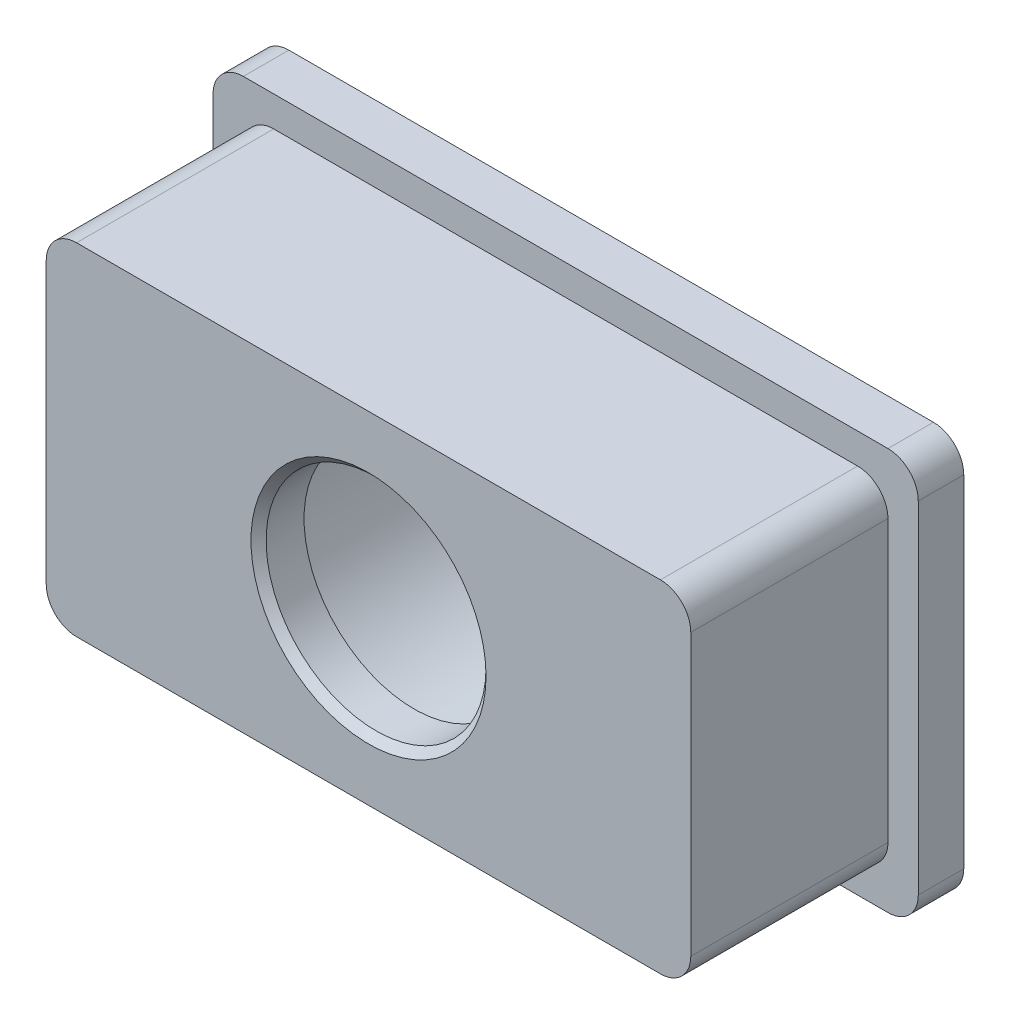
ISO-10303-21;
HEADER;
FILE_DESCRIPTION(('STEP AP214'),'2;1');
FILE_NAME('part.step','',(''),(''),'','','');
FILE_SCHEMA(('AUTOMOTIVE_DESIGN { 1 0 10303 214 1 1 1 1 }'));
ENDSEC;
DATA;
#1=APPLICATION_CONTEXT('core data for automotive mechanical design processes');
#2=APPLICATION_PROTOCOL_DEFINITION('international standard','automotive_design',2000,#1);
#3=PRODUCT_CONTEXT('',#1,'mechanical');
#4=PRODUCT('Part','Part','',(#3));
#5=PRODUCT_RELATED_PRODUCT_CATEGORY('part','',(#4));
#6=PRODUCT_DEFINITION_FORMATION('','',#4);
#7=PRODUCT_DEFINITION_CONTEXT('part definition',#1,'design');
#8=PRODUCT_DEFINITION('design','',#6,#7);
#9=PRODUCT_DEFINITION_SHAPE('','',#8);
#10=(LENGTH_UNIT() NAMED_UNIT(*) SI_UNIT(.MILLI.,.METRE.));
#11=(NAMED_UNIT(*) PLANE_ANGLE_UNIT() SI_UNIT($,.RADIAN.));
#12=(NAMED_UNIT(*) SI_UNIT($,.STERADIAN.) SOLID_ANGLE_UNIT());
#13=UNCERTAINTY_MEASURE_WITH_UNIT(LENGTH_MEASURE(1.E-05),#10,'distance_accuracy_value','');
#14=(GEOMETRIC_REPRESENTATION_CONTEXT(3) GLOBAL_UNCERTAINTY_ASSIGNED_CONTEXT((#13)) GLOBAL_UNIT_ASSIGNED_CONTEXT((#10,
#11,#12)) REPRESENTATION_CONTEXT('',''));
#15=CARTESIAN_POINT('',(0.,0.,0.));
#16=DIRECTION('',(0.,0.,1.));
#17=DIRECTION('',(1.,0.,0.));
#18=AXIS2_PLACEMENT_3D('',#15,#16,#17);
#19=CARTESIAN_POINT('',(0.,0.,13.001));
#20=DIRECTION('',(0.,0.,-1.));
#21=DIRECTION('',(-1.,0.,0.));
#22=AXIS2_PLACEMENT_3D('',#19,#20,#21);
#23=CYLINDRICAL_SURFACE('',#22,10.25);
#24=CARTESIAN_POINT('',(0.,0.,-2.49999999999999));
#25=DIRECTION('',(0.,0.,-1.));
#26=DIRECTION('',(-1.,0.,0.));
#27=AXIS2_PLACEMENT_3D('',#24,#25,#26);
#28=CIRCLE('',#27,10.25);
#29=CARTESIAN_POINT('',(-10.25,0.,-2.49999999999999));
#30=VERTEX_POINT('',#29);
#31=EDGE_CURVE('E42',#30,#30,#28,.T.);
#32=ORIENTED_EDGE('',*,*,#31,.T.);
#33=EDGE_LOOP('',(#32));
#34=FACE_BOUND('',#33,.T.);
#35=CARTESIAN_POINT('',(0.,0.,10.));
#36=DIRECTION('',(0.,0.,1.));
#37=DIRECTION('',(1.,0.,0.));
#38=AXIS2_PLACEMENT_3D('',#35,#36,#37);
#39=CIRCLE('',#38,10.25);
#40=CARTESIAN_POINT('',(10.25,0.,10.));
#41=VERTEX_POINT('',#40);
#42=EDGE_CURVE('E202',#41,#41,#39,.F.);
#43=ORIENTED_EDGE('',*,*,#42,.F.);
#44=EDGE_LOOP('',(#43));
#45=FACE_BOUND('',#44,.T.);
#46=ADVANCED_FACE('F34',(#34,#45),#23,.F.);
#47=CARTESIAN_POINT('',(21.25,11.25,13.));
#48=DIRECTION('',(-1.,0.,0.));
#49=DIRECTION('',(0.,0.,1.));
#50=AXIS2_PLACEMENT_3D('',#47,#48,#49);
#51=PLANE('',#50);
#52=DIRECTION('',(0.,1.,0.));
#53=VECTOR('',#52,1.);
#54=CARTESIAN_POINT('',(21.25,11.25,0.));
#55=LINE('',#54,#53);
#56=CARTESIAN_POINT('',(21.25,-9.24999999999999,0.));
#57=VERTEX_POINT('',#56);
#58=CARTESIAN_POINT('',(21.25,9.25,0.));
#59=VERTEX_POINT('',#58);
#60=EDGE_CURVE('E203',#57,#59,#55,.T.);
#61=ORIENTED_EDGE('',*,*,#60,.T.);
#62=DIRECTION('',(0.,0.,-1.));
#63=VECTOR('',#62,1.);
#64=CARTESIAN_POINT('',(21.25,9.25,13.));
#65=LINE('',#64,#63);
#66=CARTESIAN_POINT('',(21.25,9.25,13.));
#67=VERTEX_POINT('',#66);
#68=EDGE_CURVE('E249',#59,#67,#65,.F.);
#69=ORIENTED_EDGE('',*,*,#68,.T.);
#70=DIRECTION('',(0.,1.,0.));
#71=VECTOR('',#70,1.);
#72=CARTESIAN_POINT('',(21.25,11.25,13.));
#73=LINE('',#72,#71);
#74=CARTESIAN_POINT('',(21.25,-9.24999999999999,13.));
#75=VERTEX_POINT('',#74);
#76=EDGE_CURVE('E191',#75,#67,#73,.T.);
#77=ORIENTED_EDGE('',*,*,#76,.F.);
#78=DIRECTION('',(0.,0.,-1.));
#79=VECTOR('',#78,1.);
#80=CARTESIAN_POINT('',(21.25,-9.25,13.));
#81=LINE('',#80,#79);
#82=EDGE_CURVE('E246',#75,#57,#81,.T.);
#83=ORIENTED_EDGE('',*,*,#82,.T.);
#84=EDGE_LOOP('',(#61,#69,#77,#83));
#85=FACE_BOUND('',#84,.T.);
#86=ADVANCED_FACE('F295',(#85),#51,.F.);
#87=CARTESIAN_POINT('',(-21.25,11.25,13.));
#88=DIRECTION('',(0.,-1.,0.));
#89=DIRECTION('',(0.,0.,-1.));
#90=AXIS2_PLACEMENT_3D('',#87,#88,#89);
#91=PLANE('',#90);
#92=DIRECTION('',(-1.,0.,0.));
#93=VECTOR('',#92,1.);
#94=CARTESIAN_POINT('',(-21.25,11.25,13.));
#95=LINE('',#94,#93);
#96=CARTESIAN_POINT('',(19.25,11.25,13.));
#97=VERTEX_POINT('',#96);
#98=CARTESIAN_POINT('',(-19.25,11.25,13.));
#99=VERTEX_POINT('',#98);
#100=EDGE_CURVE('E194',#97,#99,#95,.T.);
#101=ORIENTED_EDGE('',*,*,#100,.F.);
#102=DIRECTION('',(0.,0.,-1.));
#103=VECTOR('',#102,1.);
#104=CARTESIAN_POINT('',(19.25,11.25,13.));
#105=LINE('',#104,#103);
#106=CARTESIAN_POINT('',(19.25,11.25,0.));
#107=VERTEX_POINT('',#106);
#108=EDGE_CURVE('E243',#97,#107,#105,.T.);
#109=ORIENTED_EDGE('',*,*,#108,.T.);
#110=DIRECTION('',(-1.,0.,0.));
#111=VECTOR('',#110,1.);
#112=CARTESIAN_POINT('',(-21.25,11.25,0.));
#113=LINE('',#112,#111);
#114=CARTESIAN_POINT('',(-19.25,11.25,0.));
#115=VERTEX_POINT('',#114);
#116=EDGE_CURVE('E206',#107,#115,#113,.T.);
#117=ORIENTED_EDGE('',*,*,#116,.T.);
#118=DIRECTION('',(0.,0.,-1.));
#119=VECTOR('',#118,1.);
#120=CARTESIAN_POINT('',(-19.25,11.25,13.));
#121=LINE('',#120,#119);
#122=EDGE_CURVE('E241',#115,#99,#121,.F.);
#123=ORIENTED_EDGE('',*,*,#122,.T.);
#124=EDGE_LOOP('',(#101,#109,#117,#123));
#125=FACE_BOUND('',#124,.T.);
#126=ADVANCED_FACE('F300',(#125),#91,.F.);
#127=CARTESIAN_POINT('',(-21.25,11.25,13.));
#128=DIRECTION('',(1.,0.,0.));
#129=DIRECTION('',(0.,1.,0.));
#130=AXIS2_PLACEMENT_3D('',#127,#128,#129);
#131=PLANE('',#130);
#132=DIRECTION('',(0.,-1.,0.));
#133=VECTOR('',#132,1.);
#134=CARTESIAN_POINT('',(-21.25,11.25,13.));
#135=LINE('',#134,#133);
#136=CARTESIAN_POINT('',(-21.25,9.25,13.));
#137=VERTEX_POINT('',#136);
#138=CARTESIAN_POINT('',(-21.25,-9.24999999999999,13.));
#139=VERTEX_POINT('',#138);
#140=EDGE_CURVE('E198',#137,#139,#135,.T.);
#141=ORIENTED_EDGE('',*,*,#140,.F.);
#142=DIRECTION('',(0.,0.,-1.));
#143=VECTOR('',#142,1.);
#144=CARTESIAN_POINT('',(-21.25,9.25,13.));
#145=LINE('',#144,#143);
#146=CARTESIAN_POINT('',(-21.25,9.25,0.));
#147=VERTEX_POINT('',#146);
#148=EDGE_CURVE('E260',#137,#147,#145,.T.);
#149=ORIENTED_EDGE('',*,*,#148,.T.);
#150=DIRECTION('',(0.,-1.,0.));
#151=VECTOR('',#150,1.);
#152=CARTESIAN_POINT('',(-21.25,11.25,0.));
#153=LINE('',#152,#151);
#154=CARTESIAN_POINT('',(-21.25,-9.24999999999999,0.));
#155=VERTEX_POINT('',#154);
#156=EDGE_CURVE('E209',#147,#155,#153,.T.);
#157=ORIENTED_EDGE('',*,*,#156,.T.);
#158=DIRECTION('',(0.,0.,-1.));
#159=VECTOR('',#158,1.);
#160=CARTESIAN_POINT('',(-21.25,-9.25,13.));
#161=LINE('',#160,#159);
#162=EDGE_CURVE('E258',#155,#139,#161,.F.);
#163=ORIENTED_EDGE('',*,*,#162,.T.);
#164=EDGE_LOOP('',(#141,#149,#157,#163));
#165=FACE_BOUND('',#164,.T.);
#166=ADVANCED_FACE('F335',(#165),#131,.F.);
#167=CARTESIAN_POINT('',(-21.25,-11.25,13.));
#168=DIRECTION('',(0.,1.,0.));
#169=DIRECTION('',(0.,0.,1.));
#170=AXIS2_PLACEMENT_3D('',#167,#168,#169);
#171=PLANE('',#170);
#172=DIRECTION('',(1.,0.,0.));
#173=VECTOR('',#172,1.);
#174=CARTESIAN_POINT('',(-21.25,-11.25,13.));
#175=LINE('',#174,#173);
#176=CARTESIAN_POINT('',(-19.25,-11.25,13.));
#177=VERTEX_POINT('',#176);
#178=CARTESIAN_POINT('',(19.25,-11.25,13.));
#179=VERTEX_POINT('',#178);
#180=EDGE_CURVE('E200',#177,#179,#175,.T.);
#181=ORIENTED_EDGE('',*,*,#180,.F.);
#182=DIRECTION('',(0.,0.,-1.));
#183=VECTOR('',#182,1.);
#184=CARTESIAN_POINT('',(-19.25,-11.25,13.));
#185=LINE('',#184,#183);
#186=CARTESIAN_POINT('',(-19.25,-11.25,0.));
#187=VERTEX_POINT('',#186);
#188=EDGE_CURVE('E264',#177,#187,#185,.T.);
#189=ORIENTED_EDGE('',*,*,#188,.T.);
#190=DIRECTION('',(1.,0.,0.));
#191=VECTOR('',#190,1.);
#192=CARTESIAN_POINT('',(-21.25,-11.25,0.));
#193=LINE('',#192,#191);
#194=CARTESIAN_POINT('',(19.25,-11.25,0.));
#195=VERTEX_POINT('',#194);
#196=EDGE_CURVE('E195',#187,#195,#193,.T.);
#197=ORIENTED_EDGE('',*,*,#196,.T.);
#198=DIRECTION('',(0.,0.,-1.));
#199=VECTOR('',#198,1.);
#200=CARTESIAN_POINT('',(19.25,-11.25,13.));
#201=LINE('',#200,#199);
#202=EDGE_CURVE('E49',#195,#179,#201,.F.);
#203=ORIENTED_EDGE('',*,*,#202,.T.);
#204=EDGE_LOOP('',(#181,#189,#197,#203));
#205=FACE_BOUND('',#204,.T.);
#206=ADVANCED_FACE('F331',(#205),#171,.F.);
#207=CARTESIAN_POINT('',(0.,0.,13.));
#208=DIRECTION('',(0.,0.,1.));
#209=DIRECTION('',(1.,0.,0.));
#210=AXIS2_PLACEMENT_3D('',#207,#208,#209);
#211=PLANE('',#210);
#212=CARTESIAN_POINT('',(0.,0.,13.));
#213=DIRECTION('',(0.,0.,1.));
#214=DIRECTION('',(1.,0.,0.));
#215=AXIS2_PLACEMENT_3D('',#212,#213,#214);
#216=CIRCLE('',#215,7.75000000000002);
#217=CARTESIAN_POINT('',(7.75000000000002,0.,13.));
#218=VERTEX_POINT('',#217);
#219=EDGE_CURVE('E278',#218,#218,#216,.F.);
#220=ORIENTED_EDGE('',*,*,#219,.T.);
#221=EDGE_LOOP('',(#220));
#222=FACE_BOUND('',#221,.T.);
#223=ORIENTED_EDGE('',*,*,#76,.T.);
#224=CARTESIAN_POINT('',(19.25,9.25,13.));
#225=DIRECTION('',(0.,0.,1.));
#226=DIRECTION('',(1.,0.,0.));
#227=AXIS2_PLACEMENT_3D('',#224,#225,#226);
#228=CIRCLE('',#227,2.);
#229=EDGE_CURVE('E256',#67,#97,#228,.T.);
#230=ORIENTED_EDGE('',*,*,#229,.T.);
#231=ORIENTED_EDGE('',*,*,#100,.T.);
#232=CARTESIAN_POINT('',(-19.25,9.25,13.));
#233=DIRECTION('',(0.,0.,1.));
#234=DIRECTION('',(1.,0.,0.));
#235=AXIS2_PLACEMENT_3D('',#232,#233,#234);
#236=CIRCLE('',#235,2.);
#237=EDGE_CURVE('E254',#99,#137,#236,.T.);
#238=ORIENTED_EDGE('',*,*,#237,.T.);
#239=ORIENTED_EDGE('',*,*,#140,.T.);
#240=CARTESIAN_POINT('',(-19.25,-9.25,13.));
#241=DIRECTION('',(0.,0.,1.));
#242=DIRECTION('',(1.,0.,0.));
#243=AXIS2_PLACEMENT_3D('',#240,#241,#242);
#244=CIRCLE('',#243,2.);
#245=EDGE_CURVE('E56',#139,#177,#244,.T.);
#246=ORIENTED_EDGE('',*,*,#245,.T.);
#247=ORIENTED_EDGE('',*,*,#180,.T.);
#248=CARTESIAN_POINT('',(19.25,-9.25,13.));
#249=DIRECTION('',(0.,0.,1.));
#250=DIRECTION('',(1.,0.,0.));
#251=AXIS2_PLACEMENT_3D('',#248,#249,#250);
#252=CIRCLE('',#251,2.);
#253=EDGE_CURVE('E251',#179,#75,#252,.T.);
#254=ORIENTED_EDGE('',*,*,#253,.T.);
#255=EDGE_LOOP('',(#223,#230,#231,#238,#239,#246,#247,#254));
#256=FACE_BOUND('',#255,.T.);
#257=ADVANCED_FACE('F328',(#222,#256),#211,.T.);
#258=CARTESIAN_POINT('',(-23.25,13.25,-3.));
#259=DIRECTION('',(1.,0.,0.));
#260=DIRECTION('',(0.,0.,-1.));
#261=AXIS2_PLACEMENT_3D('',#258,#259,#260);
#262=PLANE('',#261);
#263=DIRECTION('',(0.,1.,0.));
#264=VECTOR('',#263,1.);
#265=CARTESIAN_POINT('',(-23.25,13.25,-3.));
#266=LINE('',#265,#264);
#267=CARTESIAN_POINT('',(-23.25,-11.25,-3.));
#268=VERTEX_POINT('',#267);
#269=CARTESIAN_POINT('',(-23.25,11.25,-3.));
#270=VERTEX_POINT('',#269);
#271=EDGE_CURVE('E169',#268,#270,#266,.T.);
#272=ORIENTED_EDGE('',*,*,#271,.F.);
#273=DIRECTION('',(0.,0.,1.));
#274=VECTOR('',#273,1.);
#275=CARTESIAN_POINT('',(-23.25,-11.25,-3.));
#276=LINE('',#275,#274);
#277=CARTESIAN_POINT('',(-23.25,-11.25,0.));
#278=VERTEX_POINT('',#277);
#279=EDGE_CURVE('E153',#268,#278,#276,.T.);
#280=ORIENTED_EDGE('',*,*,#279,.T.);
#281=DIRECTION('',(0.,1.,0.));
#282=VECTOR('',#281,1.);
#283=CARTESIAN_POINT('',(-23.25,13.25,0.));
#284=LINE('',#283,#282);
#285=CARTESIAN_POINT('',(-23.25,11.25,0.));
#286=VERTEX_POINT('',#285);
#287=EDGE_CURVE('E166',#278,#286,#284,.T.);
#288=ORIENTED_EDGE('',*,*,#287,.T.);
#289=DIRECTION('',(0.,0.,1.));
#290=VECTOR('',#289,1.);
#291=CARTESIAN_POINT('',(-23.25,11.25,-3.));
#292=LINE('',#291,#290);
#293=EDGE_CURVE('E171',#286,#270,#292,.F.);
#294=ORIENTED_EDGE('',*,*,#293,.T.);
#295=EDGE_LOOP('',(#272,#280,#288,#294));
#296=FACE_BOUND('',#295,.T.);
#297=ADVANCED_FACE('F165',(#296),#262,.F.);
#298=CARTESIAN_POINT('',(23.25,13.25,-3.));
#299=DIRECTION('',(0.,-1.,0.));
#300=DIRECTION('',(0.,0.,-1.));
#301=AXIS2_PLACEMENT_3D('',#298,#299,#300);
#302=PLANE('',#301);
#303=DIRECTION('',(1.,0.,0.));
#304=VECTOR('',#303,1.);
#305=CARTESIAN_POINT('',(23.25,13.25,-3.));
#306=LINE('',#305,#304);
#307=CARTESIAN_POINT('',(-21.25,13.25,-3.));
#308=VERTEX_POINT('',#307);
#309=CARTESIAN_POINT('',(21.25,13.25,-3.));
#310=VERTEX_POINT('',#309);
#311=EDGE_CURVE('E552',#308,#310,#306,.T.);
#312=ORIENTED_EDGE('',*,*,#311,.F.);
#313=DIRECTION('',(0.,0.,1.));
#314=VECTOR('',#313,1.);
#315=CARTESIAN_POINT('',(-21.25,13.25,-3.));
#316=LINE('',#315,#314);
#317=CARTESIAN_POINT('',(-21.25,13.25,0.));
#318=VERTEX_POINT('',#317);
#319=EDGE_CURVE('E233',#308,#318,#316,.T.);
#320=ORIENTED_EDGE('',*,*,#319,.T.);
#321=DIRECTION('',(1.,0.,0.));
#322=VECTOR('',#321,1.);
#323=CARTESIAN_POINT('',(23.25,13.25,0.));
#324=LINE('',#323,#322);
#325=CARTESIAN_POINT('',(21.25,13.25,0.));
#326=VERTEX_POINT('',#325);
#327=EDGE_CURVE('E175',#318,#326,#324,.T.);
#328=ORIENTED_EDGE('',*,*,#327,.T.);
#329=DIRECTION('',(0.,0.,1.));
#330=VECTOR('',#329,1.);
#331=CARTESIAN_POINT('',(21.25,13.25,-3.));
#332=LINE('',#331,#330);
#333=EDGE_CURVE('E231',#326,#310,#332,.F.);
#334=ORIENTED_EDGE('',*,*,#333,.T.);
#335=EDGE_LOOP('',(#312,#320,#328,#334));
#336=FACE_BOUND('',#335,.T.);
#337=ADVANCED_FACE('F321',(#336),#302,.F.);
#338=CARTESIAN_POINT('',(23.25,13.25,-3.));
#339=DIRECTION('',(-1.,0.,0.));
#340=DIRECTION('',(0.,0.,1.));
#341=AXIS2_PLACEMENT_3D('',#338,#339,#340);
#342=PLANE('',#341);
#343=DIRECTION('',(0.,-1.,0.));
#344=VECTOR('',#343,1.);
#345=CARTESIAN_POINT('',(23.25,13.25,0.));
#346=LINE('',#345,#344);
#347=CARTESIAN_POINT('',(23.25,11.25,0.));
#348=VERTEX_POINT('',#347);
#349=CARTESIAN_POINT('',(23.25,-11.25,0.));
#350=VERTEX_POINT('',#349);
#351=EDGE_CURVE('E179',#348,#350,#346,.T.);
#352=ORIENTED_EDGE('',*,*,#351,.T.);
#353=DIRECTION('',(0.,0.,1.));
#354=VECTOR('',#353,1.);
#355=CARTESIAN_POINT('',(23.25,-11.25,-3.));
#356=LINE('',#355,#354);
#357=CARTESIAN_POINT('',(23.25,-11.25,-3.));
#358=VERTEX_POINT('',#357);
#359=EDGE_CURVE('E239',#350,#358,#356,.F.);
#360=ORIENTED_EDGE('',*,*,#359,.T.);
#361=DIRECTION('',(0.,-1.,0.));
#362=VECTOR('',#361,1.);
#363=CARTESIAN_POINT('',(23.25,13.25,-3.));
#364=LINE('',#363,#362);
#365=CARTESIAN_POINT('',(23.25,11.25,-3.));
#366=VERTEX_POINT('',#365);
#367=EDGE_CURVE('E549',#366,#358,#364,.T.);
#368=ORIENTED_EDGE('',*,*,#367,.F.);
#369=DIRECTION('',(0.,0.,1.));
#370=VECTOR('',#369,1.);
#371=CARTESIAN_POINT('',(23.25,11.25,-3.));
#372=LINE('',#371,#370);
#373=EDGE_CURVE('E236',#366,#348,#372,.T.);
#374=ORIENTED_EDGE('',*,*,#373,.T.);
#375=EDGE_LOOP('',(#352,#360,#368,#374));
#376=FACE_BOUND('',#375,.T.);
#377=ADVANCED_FACE('F317',(#376),#342,.F.);
#378=CARTESIAN_POINT('',(23.25,-13.25,-3.));
#379=DIRECTION('',(0.,1.,0.));
#380=DIRECTION('',(0.,0.,1.));
#381=AXIS2_PLACEMENT_3D('',#378,#379,#380);
#382=PLANE('',#381);
#383=DIRECTION('',(-1.,0.,0.));
#384=VECTOR('',#383,1.);
#385=CARTESIAN_POINT('',(23.25,-13.25,0.));
#386=LINE('',#385,#384);
#387=CARTESIAN_POINT('',(21.25,-13.25,0.));
#388=VERTEX_POINT('',#387);
#389=CARTESIAN_POINT('',(-21.25,-13.25,0.));
#390=VERTEX_POINT('',#389);
#391=EDGE_CURVE('E189',#388,#390,#386,.T.);
#392=ORIENTED_EDGE('',*,*,#391,.T.);
#393=DIRECTION('',(0.,0.,1.));
#394=VECTOR('',#393,1.);
#395=CARTESIAN_POINT('',(-21.25,-13.25,-3.));
#396=LINE('',#395,#394);
#397=CARTESIAN_POINT('',(-21.25,-13.25,-3.));
#398=VERTEX_POINT('',#397);
#399=EDGE_CURVE('E154',#390,#398,#396,.F.);
#400=ORIENTED_EDGE('',*,*,#399,.T.);
#401=DIRECTION('',(-1.,0.,0.));
#402=VECTOR('',#401,1.);
#403=CARTESIAN_POINT('',(23.25,-13.25,-3.));
#404=LINE('',#403,#402);
#405=CARTESIAN_POINT('',(21.25,-13.25,-3.));
#406=VERTEX_POINT('',#405);
#407=EDGE_CURVE('E184',#406,#398,#404,.T.);
#408=ORIENTED_EDGE('',*,*,#407,.F.);
#409=DIRECTION('',(0.,0.,1.));
#410=VECTOR('',#409,1.);
#411=CARTESIAN_POINT('',(21.25,-13.25,-3.));
#412=LINE('',#411,#410);
#413=EDGE_CURVE('E159',#406,#388,#412,.T.);
#414=ORIENTED_EDGE('',*,*,#413,.T.);
#415=EDGE_LOOP('',(#392,#400,#408,#414));
#416=FACE_BOUND('',#415,.T.);
#417=ADVANCED_FACE('F310',(#416),#382,.F.);
#418=CARTESIAN_POINT('',(0.,0.,-3.));
#419=DIRECTION('',(0.,0.,-1.));
#420=DIRECTION('',(-1.,0.,0.));
#421=AXIS2_PLACEMENT_3D('',#418,#419,#420);
#422=PLANE('',#421);
#423=CARTESIAN_POINT('',(0.,0.,-3.));
#424=DIRECTION('',(0.,0.,-1.));
#425=DIRECTION('',(-1.,0.,0.));
#426=AXIS2_PLACEMENT_3D('',#423,#424,#425);
#427=CIRCLE('',#426,10.75);
#428=CARTESIAN_POINT('',(-10.75,0.,-3.));
#429=VERTEX_POINT('',#428);
#430=EDGE_CURVE('E11',#429,#429,#427,.F.);
#431=ORIENTED_EDGE('',*,*,#430,.T.);
#432=EDGE_LOOP('',(#431));
#433=FACE_BOUND('',#432,.T.);
#434=ORIENTED_EDGE('',*,*,#407,.T.);
#435=CARTESIAN_POINT('',(-21.25,-11.25,-3.));
#436=DIRECTION('',(0.,0.,-1.));
#437=DIRECTION('',(-1.,0.,0.));
#438=AXIS2_PLACEMENT_3D('',#435,#436,#437);
#439=CIRCLE('',#438,2.);
#440=EDGE_CURVE('E229',#398,#268,#439,.T.);
#441=ORIENTED_EDGE('',*,*,#440,.T.);
#442=ORIENTED_EDGE('',*,*,#271,.T.);
#443=CARTESIAN_POINT('',(-21.25,11.25,-3.));
#444=DIRECTION('',(0.,0.,-1.));
#445=DIRECTION('',(-1.,0.,0.));
#446=AXIS2_PLACEMENT_3D('',#443,#444,#445);
#447=CIRCLE('',#446,2.);
#448=EDGE_CURVE('E227',#270,#308,#447,.T.);
#449=ORIENTED_EDGE('',*,*,#448,.T.);
#450=ORIENTED_EDGE('',*,*,#311,.T.);
#451=CARTESIAN_POINT('',(21.25,11.25,-3.));
#452=DIRECTION('',(0.,0.,-1.));
#453=DIRECTION('',(-1.,0.,0.));
#454=AXIS2_PLACEMENT_3D('',#451,#452,#453);
#455=CIRCLE('',#454,2.);
#456=EDGE_CURVE('E223',#310,#366,#455,.T.);
#457=ORIENTED_EDGE('',*,*,#456,.T.);
#458=ORIENTED_EDGE('',*,*,#367,.T.);
#459=CARTESIAN_POINT('',(21.25,-11.25,-3.));
#460=DIRECTION('',(0.,0.,-1.));
#461=DIRECTION('',(-1.,0.,0.));
#462=AXIS2_PLACEMENT_3D('',#459,#460,#461);
#463=CIRCLE('',#462,2.);
#464=EDGE_CURVE('E225',#358,#406,#463,.T.);
#465=ORIENTED_EDGE('',*,*,#464,.T.);
#466=EDGE_LOOP('',(#434,#441,#442,#449,#450,#457,#458,#465));
#467=FACE_BOUND('',#466,.T.);
#468=ADVANCED_FACE('F307',(#433,#467),#422,.T.);
#469=CARTESIAN_POINT('',(0.,0.,0.));
#470=DIRECTION('',(0.,0.,-1.));
#471=DIRECTION('',(-1.,0.,0.));
#472=AXIS2_PLACEMENT_3D('',#469,#470,#471);
#473=PLANE('',#472);
#474=ORIENTED_EDGE('',*,*,#60,.F.);
#475=CARTESIAN_POINT('',(19.25,-9.25,0.));
#476=DIRECTION('',(0.,0.,-1.));
#477=DIRECTION('',(-1.,0.,0.));
#478=AXIS2_PLACEMENT_3D('',#475,#476,#477);
#479=CIRCLE('',#478,2.);
#480=EDGE_CURVE('E273',#57,#195,#479,.T.);
#481=ORIENTED_EDGE('',*,*,#480,.T.);
#482=ORIENTED_EDGE('',*,*,#196,.F.);
#483=CARTESIAN_POINT('',(-19.25,-9.25,0.));
#484=DIRECTION('',(0.,0.,-1.));
#485=DIRECTION('',(-1.,0.,0.));
#486=AXIS2_PLACEMENT_3D('',#483,#484,#485);
#487=CIRCLE('',#486,2.);
#488=EDGE_CURVE('E271',#187,#155,#487,.T.);
#489=ORIENTED_EDGE('',*,*,#488,.T.);
#490=ORIENTED_EDGE('',*,*,#156,.F.);
#491=CARTESIAN_POINT('',(-19.25,9.25,0.));
#492=DIRECTION('',(0.,0.,-1.));
#493=DIRECTION('',(-1.,0.,0.));
#494=AXIS2_PLACEMENT_3D('',#491,#492,#493);
#495=CIRCLE('',#494,2.);
#496=EDGE_CURVE('E269',#147,#115,#495,.T.);
#497=ORIENTED_EDGE('',*,*,#496,.T.);
#498=ORIENTED_EDGE('',*,*,#116,.F.);
#499=CARTESIAN_POINT('',(19.25,9.25,0.));
#500=DIRECTION('',(0.,0.,-1.));
#501=DIRECTION('',(-1.,0.,0.));
#502=AXIS2_PLACEMENT_3D('',#499,#500,#501);
#503=CIRCLE('',#502,2.);
#504=EDGE_CURVE('E267',#107,#59,#503,.T.);
#505=ORIENTED_EDGE('',*,*,#504,.T.);
#506=EDGE_LOOP('',(#474,#481,#482,#489,#490,#497,#498,#505));
#507=FACE_BOUND('',#506,.T.);
#508=ORIENTED_EDGE('',*,*,#287,.F.);
#509=CARTESIAN_POINT('',(-21.25,-11.25,0.));
#510=DIRECTION('',(0.,0.,-1.));
#511=DIRECTION('',(-1.,0.,0.));
#512=AXIS2_PLACEMENT_3D('',#509,#510,#511);
#513=CIRCLE('',#512,2.);
#514=EDGE_CURVE('E149',#278,#390,#513,.F.);
#515=ORIENTED_EDGE('',*,*,#514,.T.);
#516=ORIENTED_EDGE('',*,*,#391,.F.);
#517=CARTESIAN_POINT('',(21.25,-11.25,0.));
#518=DIRECTION('',(0.,0.,-1.));
#519=DIRECTION('',(-1.,0.,0.));
#520=AXIS2_PLACEMENT_3D('',#517,#518,#519);
#521=CIRCLE('',#520,2.);
#522=EDGE_CURVE('E217',#388,#350,#521,.F.);
#523=ORIENTED_EDGE('',*,*,#522,.T.);
#524=ORIENTED_EDGE('',*,*,#351,.F.);
#525=CARTESIAN_POINT('',(21.25,11.25,0.));
#526=DIRECTION('',(0.,0.,-1.));
#527=DIRECTION('',(-1.,0.,0.));
#528=AXIS2_PLACEMENT_3D('',#525,#526,#527);
#529=CIRCLE('',#528,2.);
#530=EDGE_CURVE('E170',#348,#326,#529,.F.);
#531=ORIENTED_EDGE('',*,*,#530,.T.);
#532=ORIENTED_EDGE('',*,*,#327,.F.);
#533=CARTESIAN_POINT('',(-21.25,11.25,0.));
#534=DIRECTION('',(0.,0.,-1.));
#535=DIRECTION('',(-1.,0.,0.));
#536=AXIS2_PLACEMENT_3D('',#533,#534,#535);
#537=CIRCLE('',#536,2.);
#538=EDGE_CURVE('E160',#318,#286,#537,.F.);
#539=ORIENTED_EDGE('',*,*,#538,.T.);
#540=EDGE_LOOP('',(#508,#515,#516,#523,#524,#531,#532,#539));
#541=FACE_BOUND('',#540,.T.);
#542=ADVANCED_FACE('F173',(#507,#541),#473,.F.);
#543=CARTESIAN_POINT('',(0.,0.,10.));
#544=DIRECTION('',(0.,0.,1.));
#545=DIRECTION('',(1.,0.,0.));
#546=AXIS2_PLACEMENT_3D('',#543,#544,#545);
#547=PLANE('',#546);
#548=CARTESIAN_POINT('',(0.,0.,10.));
#549=DIRECTION('',(0.,0.,1.));
#550=DIRECTION('',(1.,0.,0.));
#551=AXIS2_PLACEMENT_3D('',#548,#549,#550);
#552=CIRCLE('',#551,7.25);
#553=CARTESIAN_POINT('',(7.25,0.,10.));
#554=VERTEX_POINT('',#553);
#555=EDGE_CURVE('E176',#554,#554,#552,.T.);
#556=ORIENTED_EDGE('',*,*,#555,.T.);
#557=EDGE_LOOP('',(#556));
#558=FACE_BOUND('',#557,.T.);
#559=ORIENTED_EDGE('',*,*,#42,.T.);
#560=EDGE_LOOP('',(#559));
#561=FACE_BOUND('',#560,.T.);
#562=ADVANCED_FACE('F305',(#558,#561),#547,.F.);
#563=CARTESIAN_POINT('',(0.,0.,10.));
#564=DIRECTION('',(0.,0.,1.));
#565=DIRECTION('',(1.,0.,0.));
#566=AXIS2_PLACEMENT_3D('',#563,#564,#565);
#567=CYLINDRICAL_SURFACE('',#566,7.25);
#568=CARTESIAN_POINT('',(0.,0.,12.5));
#569=DIRECTION('',(0.,0.,1.));
#570=DIRECTION('',(1.,0.,0.));
#571=AXIS2_PLACEMENT_3D('',#568,#569,#570);
#572=CIRCLE('',#571,7.25);
#573=CARTESIAN_POINT('',(7.25,0.,12.5));
#574=VERTEX_POINT('',#573);
#575=EDGE_CURVE('E275',#574,#574,#572,.T.);
#576=ORIENTED_EDGE('',*,*,#575,.T.);
#577=EDGE_LOOP('',(#576));
#578=FACE_BOUND('',#577,.T.);
#579=ORIENTED_EDGE('',*,*,#555,.F.);
#580=EDGE_LOOP('',(#579));
#581=FACE_BOUND('',#580,.T.);
#582=ADVANCED_FACE('F345',(#578,#581),#567,.F.);
#583=CARTESIAN_POINT('',(-21.25,-11.25,-3.));
#584=DIRECTION('',(0.,0.,1.));
#585=DIRECTION('',(1.,0.,0.));
#586=AXIS2_PLACEMENT_3D('',#583,#584,#585);
#587=CYLINDRICAL_SURFACE('',#586,2.);
#588=ORIENTED_EDGE('',*,*,#440,.F.);
#589=ORIENTED_EDGE('',*,*,#399,.F.);
#590=ORIENTED_EDGE('',*,*,#514,.F.);
#591=ORIENTED_EDGE('',*,*,#279,.F.);
#592=EDGE_LOOP('',(#588,#589,#590,#591));
#593=FACE_BOUND('',#592,.T.);
#594=ADVANCED_FACE('F152',(#593),#587,.T.);
#595=CARTESIAN_POINT('',(-21.25,11.25,-3.));
#596=DIRECTION('',(0.,0.,1.));
#597=DIRECTION('',(1.,0.,0.));
#598=AXIS2_PLACEMENT_3D('',#595,#596,#597);
#599=CYLINDRICAL_SURFACE('',#598,2.);
#600=ORIENTED_EDGE('',*,*,#448,.F.);
#601=ORIENTED_EDGE('',*,*,#293,.F.);
#602=ORIENTED_EDGE('',*,*,#538,.F.);
#603=ORIENTED_EDGE('',*,*,#319,.F.);
#604=EDGE_LOOP('',(#600,#601,#602,#603));
#605=FACE_BOUND('',#604,.T.);
#606=ADVANCED_FACE('F344',(#605),#599,.T.);
#607=CARTESIAN_POINT('',(21.25,-11.25,-3.));
#608=DIRECTION('',(0.,0.,1.));
#609=DIRECTION('',(1.,0.,0.));
#610=AXIS2_PLACEMENT_3D('',#607,#608,#609);
#611=CYLINDRICAL_SURFACE('',#610,2.);
#612=ORIENTED_EDGE('',*,*,#464,.F.);
#613=ORIENTED_EDGE('',*,*,#359,.F.);
#614=ORIENTED_EDGE('',*,*,#522,.F.);
#615=ORIENTED_EDGE('',*,*,#413,.F.);
#616=EDGE_LOOP('',(#612,#613,#614,#615));
#617=FACE_BOUND('',#616,.T.);
#618=ADVANCED_FACE('F348',(#617),#611,.T.);
#619=CARTESIAN_POINT('',(21.25,11.25,-3.));
#620=DIRECTION('',(0.,0.,1.));
#621=DIRECTION('',(1.,0.,0.));
#622=AXIS2_PLACEMENT_3D('',#619,#620,#621);
#623=CYLINDRICAL_SURFACE('',#622,2.);
#624=ORIENTED_EDGE('',*,*,#456,.F.);
#625=ORIENTED_EDGE('',*,*,#333,.F.);
#626=ORIENTED_EDGE('',*,*,#530,.F.);
#627=ORIENTED_EDGE('',*,*,#373,.F.);
#628=EDGE_LOOP('',(#624,#625,#626,#627));
#629=FACE_BOUND('',#628,.T.);
#630=ADVANCED_FACE('F352',(#629),#623,.T.);
#631=CARTESIAN_POINT('',(19.25,9.25,13.));
#632=DIRECTION('',(0.,0.,-1.));
#633=DIRECTION('',(-1.,0.,0.));
#634=AXIS2_PLACEMENT_3D('',#631,#632,#633);
#635=CYLINDRICAL_SURFACE('',#634,2.);
#636=ORIENTED_EDGE('',*,*,#229,.F.);
#637=ORIENTED_EDGE('',*,*,#68,.F.);
#638=ORIENTED_EDGE('',*,*,#504,.F.);
#639=ORIENTED_EDGE('',*,*,#108,.F.);
#640=EDGE_LOOP('',(#636,#637,#638,#639));
#641=FACE_BOUND('',#640,.T.);
#642=ADVANCED_FACE('F356',(#641),#635,.T.);
#643=CARTESIAN_POINT('',(-19.25,9.25,13.));
#644=DIRECTION('',(0.,0.,-1.));
#645=DIRECTION('',(-1.,0.,0.));
#646=AXIS2_PLACEMENT_3D('',#643,#644,#645);
#647=CYLINDRICAL_SURFACE('',#646,2.);
#648=ORIENTED_EDGE('',*,*,#237,.F.);
#649=ORIENTED_EDGE('',*,*,#122,.F.);
#650=ORIENTED_EDGE('',*,*,#496,.F.);
#651=ORIENTED_EDGE('',*,*,#148,.F.);
#652=EDGE_LOOP('',(#648,#649,#650,#651));
#653=FACE_BOUND('',#652,.T.);
#654=ADVANCED_FACE('F360',(#653),#647,.T.);
#655=CARTESIAN_POINT('',(-19.25,-9.25,13.));
#656=DIRECTION('',(0.,0.,-1.));
#657=DIRECTION('',(-1.,0.,0.));
#658=AXIS2_PLACEMENT_3D('',#655,#656,#657);
#659=CYLINDRICAL_SURFACE('',#658,2.);
#660=ORIENTED_EDGE('',*,*,#245,.F.);
#661=ORIENTED_EDGE('',*,*,#162,.F.);
#662=ORIENTED_EDGE('',*,*,#488,.F.);
#663=ORIENTED_EDGE('',*,*,#188,.F.);
#664=EDGE_LOOP('',(#660,#661,#662,#663));
#665=FACE_BOUND('',#664,.T.);
#666=ADVANCED_FACE('F364',(#665),#659,.T.);
#667=CARTESIAN_POINT('',(19.25,-9.25,13.));
#668=DIRECTION('',(0.,0.,-1.));
#669=DIRECTION('',(-1.,0.,0.));
#670=AXIS2_PLACEMENT_3D('',#667,#668,#669);
#671=CYLINDRICAL_SURFACE('',#670,2.);
#672=ORIENTED_EDGE('',*,*,#253,.F.);
#673=ORIENTED_EDGE('',*,*,#202,.F.);
#674=ORIENTED_EDGE('',*,*,#480,.F.);
#675=ORIENTED_EDGE('',*,*,#82,.F.);
#676=EDGE_LOOP('',(#672,#673,#674,#675));
#677=FACE_BOUND('',#676,.T.);
#678=ADVANCED_FACE('F291',(#677),#671,.T.);
#679=CARTESIAN_POINT('',(0.,0.,12.5));
#680=DIRECTION('',(0.,0.,1.));
#681=DIRECTION('',(1.,0.,0.));
#682=AXIS2_PLACEMENT_3D('',#679,#680,#681);
#683=CONICAL_SURFACE('',#682,7.25,0.78539816339745);
#684=ORIENTED_EDGE('',*,*,#219,.F.);
#685=EDGE_LOOP('',(#684));
#686=FACE_BOUND('',#685,.T.);
#687=ORIENTED_EDGE('',*,*,#575,.F.);
#688=EDGE_LOOP('',(#687));
#689=FACE_BOUND('',#688,.T.);
#690=ADVANCED_FACE('F286',(#686,#689),#683,.F.);
#691=CARTESIAN_POINT('',(0.,0.,-2.49999999999999));
#692=DIRECTION('',(0.,0.,-1.));
#693=DIRECTION('',(-1.,0.,0.));
#694=AXIS2_PLACEMENT_3D('',#691,#692,#693);
#695=CONICAL_SURFACE('',#694,10.25,0.78539816339745);
#696=ORIENTED_EDGE('',*,*,#430,.F.);
#697=EDGE_LOOP('',(#696));
#698=FACE_BOUND('',#697,.T.);
#699=ORIENTED_EDGE('',*,*,#31,.F.);
#700=EDGE_LOOP('',(#699));
#701=FACE_BOUND('',#700,.T.);
#702=ADVANCED_FACE('F36',(#698,#701),#695,.F.);
#703=CLOSED_SHELL('',(#46,#86,#126,#166,#206,#257,#297,#337,#377,#417,#468,#542,#562,#582,#594,
#606,#618,#630,#642,#654,#666,#678,#690,#702));
#704=MANIFOLD_SOLID_BREP('B2',#703);
#705=ADVANCED_BREP_SHAPE_REPRESENTATION('',(#18,#704),#14);
#706=SHAPE_DEFINITION_REPRESENTATION(#9,#705);
ENDSEC;
END-ISO-10303-21;
